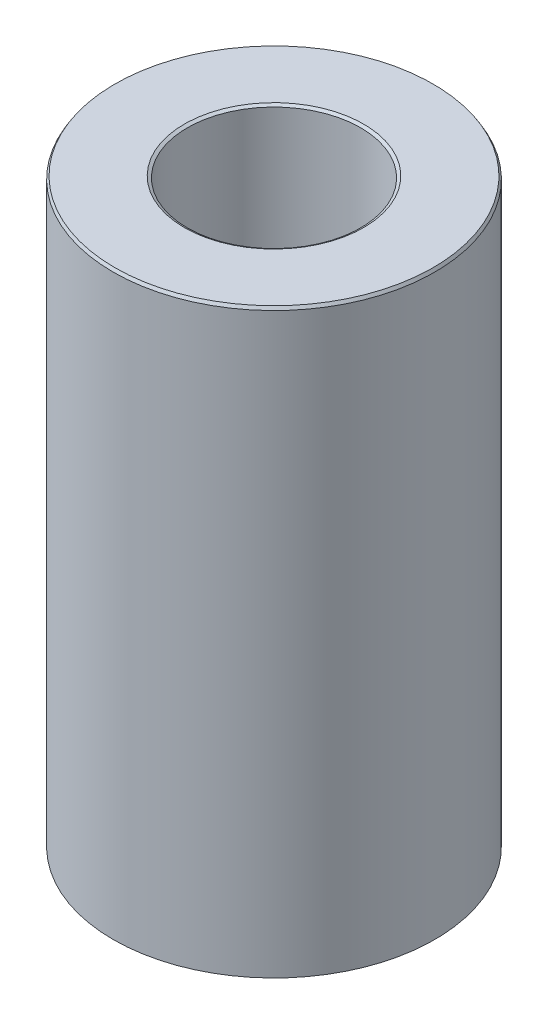
ISO-10303-21;
HEADER;
FILE_DESCRIPTION(('STEP AP214'),'2;1');
FILE_NAME('part.step','',(''),(''),'','','');
FILE_SCHEMA(('AUTOMOTIVE_DESIGN { 1 0 10303 214 1 1 1 1 }'));
ENDSEC;
DATA;
#1=APPLICATION_CONTEXT('core data for automotive mechanical design processes');
#2=APPLICATION_PROTOCOL_DEFINITION('international standard','automotive_design',2000,#1);
#3=PRODUCT_CONTEXT('',#1,'mechanical');
#4=PRODUCT('Part','Part','',(#3));
#5=PRODUCT_RELATED_PRODUCT_CATEGORY('part','',(#4));
#6=PRODUCT_DEFINITION_FORMATION('','',#4);
#7=PRODUCT_DEFINITION_CONTEXT('part definition',#1,'design');
#8=PRODUCT_DEFINITION('design','',#6,#7);
#9=PRODUCT_DEFINITION_SHAPE('','',#8);
#10=(LENGTH_UNIT() NAMED_UNIT(*) SI_UNIT(.MILLI.,.METRE.));
#11=(NAMED_UNIT(*) PLANE_ANGLE_UNIT() SI_UNIT($,.RADIAN.));
#12=(NAMED_UNIT(*) SI_UNIT($,.STERADIAN.) SOLID_ANGLE_UNIT());
#13=UNCERTAINTY_MEASURE_WITH_UNIT(LENGTH_MEASURE(1.E-05),#10,'distance_accuracy_value','');
#14=(GEOMETRIC_REPRESENTATION_CONTEXT(3) GLOBAL_UNCERTAINTY_ASSIGNED_CONTEXT((#13)) GLOBAL_UNIT_ASSIGNED_CONTEXT((#10,
#11,#12)) REPRESENTATION_CONTEXT('',''));
#15=CARTESIAN_POINT('',(0.,0.,0.));
#16=DIRECTION('',(0.,0.,1.));
#17=DIRECTION('',(1.,0.,0.));
#18=AXIS2_PLACEMENT_3D('',#15,#16,#17);
#19=CARTESIAN_POINT('',(0.,172.119803499894,0.));
#20=DIRECTION('',(0.,-1.,0.));
#21=DIRECTION('',(0.,0.,-1.));
#22=AXIS2_PLACEMENT_3D('',#19,#20,#21);
#23=CYLINDRICAL_SURFACE('',#22,47.5);
#24=CARTESIAN_POINT('',(0.,0.505788160574006,0.));
#25=DIRECTION('',(0.,1.,0.));
#26=DIRECTION('',(0.,0.,1.));
#27=AXIS2_PLACEMENT_3D('',#24,#25,#26);
#28=CIRCLE('',#27,47.5);
#29=CARTESIAN_POINT('',(0.,0.505788160574006,47.5));
#30=VERTEX_POINT('',#29);
#31=EDGE_CURVE('E10',#30,#30,#28,.T.);
#32=ORIENTED_EDGE('',*,*,#31,.T.);
#33=EDGE_LOOP('',(#32));
#34=FACE_BOUND('',#33,.T.);
#35=CARTESIAN_POINT('',(0.,171.243752707913,0.));
#36=DIRECTION('',(0.,1.,0.));
#37=DIRECTION('',(0.,0.,1.));
#38=AXIS2_PLACEMENT_3D('',#35,#36,#37);
#39=CIRCLE('',#38,47.5);
#40=CARTESIAN_POINT('',(0.,171.243752707913,47.5));
#41=VERTEX_POINT('',#40);
#42=EDGE_CURVE('E50',#41,#41,#39,.F.);
#43=ORIENTED_EDGE('',*,*,#42,.T.);
#44=EDGE_LOOP('',(#43));
#45=FACE_BOUND('',#44,.T.);
#46=ADVANCED_FACE('F39',(#34,#45),#23,.T.);
#47=CARTESIAN_POINT('',(0.,172.119803499894,0.));
#48=DIRECTION('',(0.,1.,0.));
#49=DIRECTION('',(0.,0.,1.));
#50=AXIS2_PLACEMENT_3D('',#47,#48,#49);
#51=PLANE('',#50);
#52=CARTESIAN_POINT('',(0.,172.119803499894,0.));
#53=DIRECTION('',(0.,1.,0.));
#54=DIRECTION('',(0.,0.,1.));
#55=AXIS2_PLACEMENT_3D('',#52,#53,#54);
#56=CIRCLE('',#55,26.4885482199525);
#57=CARTESIAN_POINT('',(0.,172.119803499894,26.4885482199525));
#58=VERTEX_POINT('',#57);
#59=EDGE_CURVE('E58',#58,#58,#56,.F.);
#60=ORIENTED_EDGE('',*,*,#59,.T.);
#61=EDGE_LOOP('',(#60));
#62=FACE_BOUND('',#61,.T.);
#63=CARTESIAN_POINT('',(0.,172.119803499894,0.));
#64=DIRECTION('',(0.,1.,0.));
#65=DIRECTION('',(0.,0.,1.));
#66=AXIS2_PLACEMENT_3D('',#63,#64,#65);
#67=CIRCLE('',#66,46.994211839426);
#68=CARTESIAN_POINT('',(0.,172.119803499894,46.994211839426));
#69=VERTEX_POINT('',#68);
#70=EDGE_CURVE('E61',#69,#69,#67,.T.);
#71=ORIENTED_EDGE('',*,*,#70,.T.);
#72=EDGE_LOOP('',(#71));
#73=FACE_BOUND('',#72,.T.);
#74=ADVANCED_FACE('F88',(#62,#73),#51,.T.);
#75=CARTESIAN_POINT('',(0.,0.,0.));
#76=DIRECTION('',(0.,1.,0.));
#77=DIRECTION('',(0.,0.,1.));
#78=AXIS2_PLACEMENT_3D('',#75,#76,#77);
#79=PLANE('',#78);
#80=CARTESIAN_POINT('',(0.,0.,0.));
#81=DIRECTION('',(0.,1.,0.));
#82=DIRECTION('',(0.,0.,1.));
#83=AXIS2_PLACEMENT_3D('',#80,#81,#82);
#84=CIRCLE('',#83,26.1182855885455);
#85=CARTESIAN_POINT('',(0.,0.,-26.1182855885455));
#86=VERTEX_POINT('',#85);
#87=EDGE_CURVE('E51',#86,#86,#84,.T.);
#88=ORIENTED_EDGE('',*,*,#87,.T.);
#89=EDGE_LOOP('',(#88));
#90=FACE_BOUND('',#89,.T.);
#91=CARTESIAN_POINT('',(0.,0.,0.));
#92=DIRECTION('',(0.,1.,0.));
#93=DIRECTION('',(0.,0.,1.));
#94=AXIS2_PLACEMENT_3D('',#91,#92,#93);
#95=CIRCLE('',#94,46.623949208019);
#96=CARTESIAN_POINT('',(0.,0.,46.623949208019));
#97=VERTEX_POINT('',#96);
#98=EDGE_CURVE('E54',#97,#97,#95,.F.);
#99=ORIENTED_EDGE('',*,*,#98,.T.);
#100=EDGE_LOOP('',(#99));
#101=FACE_BOUND('',#100,.T.);
#102=ADVANCED_FACE('F83',(#90,#101),#79,.F.);
#103=CARTESIAN_POINT('',(0.,172.119803499894,0.));
#104=DIRECTION('',(0.,-1.,0.));
#105=DIRECTION('',(0.,0.,-1.));
#106=AXIS2_PLACEMENT_3D('',#103,#104,#105);
#107=CYLINDRICAL_SURFACE('',#106,25.6124974279715);
#108=CARTESIAN_POINT('',(0.,171.61401533932,0.));
#109=DIRECTION('',(0.,1.,0.));
#110=DIRECTION('',(0.,0.,1.));
#111=AXIS2_PLACEMENT_3D('',#108,#109,#110);
#112=CIRCLE('',#111,25.6124974279715);
#113=CARTESIAN_POINT('',(0.,171.61401533932,25.6124974279715));
#114=VERTEX_POINT('',#113);
#115=EDGE_CURVE('E67',#114,#114,#112,.T.);
#116=ORIENTED_EDGE('',*,*,#115,.T.);
#117=EDGE_LOOP('',(#116));
#118=FACE_BOUND('',#117,.T.);
#119=CARTESIAN_POINT('',(0.,0.87605079198097,0.));
#120=DIRECTION('',(0.,1.,0.));
#121=DIRECTION('',(0.,0.,1.));
#122=AXIS2_PLACEMENT_3D('',#119,#120,#121);
#123=CIRCLE('',#122,25.6124974279715);
#124=CARTESIAN_POINT('',(0.,0.87605079198097,-25.6124974279715));
#125=VERTEX_POINT('',#124);
#126=EDGE_CURVE('E69',#125,#125,#123,.F.);
#127=ORIENTED_EDGE('',*,*,#126,.T.);
#128=EDGE_LOOP('',(#127));
#129=FACE_BOUND('',#128,.T.);
#130=ADVANCED_FACE('F71',(#118,#129),#107,.F.);
#131=CARTESIAN_POINT('',(0.,171.61401533932,0.));
#132=DIRECTION('',(0.,1.,0.));
#133=DIRECTION('',(0.,0.,1.));
#134=AXIS2_PLACEMENT_3D('',#131,#132,#133);
#135=CONICAL_SURFACE('',#134,25.6124974279715,1.04719755119661);
#136=ORIENTED_EDGE('',*,*,#59,.F.);
#137=EDGE_LOOP('',(#136));
#138=FACE_BOUND('',#137,.T.);
#139=ORIENTED_EDGE('',*,*,#115,.F.);
#140=EDGE_LOOP('',(#139));
#141=FACE_BOUND('',#140,.T.);
#142=ADVANCED_FACE('F77',(#138,#141),#135,.F.);
#143=CARTESIAN_POINT('',(0.,0.,0.));
#144=DIRECTION('',(0.,-1.,0.));
#145=DIRECTION('',(0.,0.,-1.));
#146=AXIS2_PLACEMENT_3D('',#143,#144,#145);
#147=CONICAL_SURFACE('',#146,26.1182855885455,0.523598775598296);
#148=CARTESIAN_POINT('',(0.,0.87605079198097,-25.6124974279715));
#149=CARTESIAN_POINT('',(0.,0.866925262897835,-25.6177660546442));
#150=CARTESIAN_POINT('',(0.,0.8577997338147,-25.6230346813168));
#151=CARTESIAN_POINT('',(0.,0.83954867564843,-25.6335719346621));
#152=CARTESIAN_POINT('',(0.,0.830423146565294,-25.6388405613348));
#153=CARTESIAN_POINT('',(0.,0.812172088399024,-25.6493778146801));
#154=CARTESIAN_POINT('',(0.,0.803046559315889,-25.6546464413527));
#155=CARTESIAN_POINT('',(0.,0.784795501149619,-25.665183694698));
#156=CARTESIAN_POINT('',(0.,0.775669972066484,-25.6704523213706));
#157=CARTESIAN_POINT('',(0.,0.757418913900214,-25.6809895747159));
#158=CARTESIAN_POINT('',(0.,0.748293384817079,-25.6862582013886));
#159=CARTESIAN_POINT('',(0.,0.730042326650808,-25.6967954547339));
#160=CARTESIAN_POINT('',(0.,0.720916797567673,-25.7020640814065));
#161=CARTESIAN_POINT('',(0.,0.702665739401403,-25.7126013347518));
#162=CARTESIAN_POINT('',(0.,0.693540210318268,-25.7178699614245));
#163=CARTESIAN_POINT('',(0.,0.675289152151998,-25.7284072147697));
#164=CARTESIAN_POINT('',(0.,0.666163623068863,-25.7336758414424));
#165=CARTESIAN_POINT('',(0.,0.647912564902592,-25.7442130947877));
#166=CARTESIAN_POINT('',(0.,0.638787035819457,-25.7494817214603));
#167=CARTESIAN_POINT('',(0.,0.620535977653187,-25.7600189748056));
#168=CARTESIAN_POINT('',(0.,0.611410448570052,-25.7652876014783));
#169=CARTESIAN_POINT('',(0.,0.593159390403782,-25.7758248548236));
#170=CARTESIAN_POINT('',(0.,0.584033861320647,-25.7810934814962));
#171=CARTESIAN_POINT('',(0.,0.565782803154376,-25.7916307348415));
#172=CARTESIAN_POINT('',(0.,0.556657274071241,-25.7968993615141));
#173=CARTESIAN_POINT('',(0.,0.538406215904971,-25.8074366148594));
#174=CARTESIAN_POINT('',(0.,0.529280686821836,-25.8127052415321));
#175=CARTESIAN_POINT('',(0.,0.511029628655566,-25.8232424948774));
#176=CARTESIAN_POINT('',(0.,0.501904099572431,-25.82851112155));
#177=CARTESIAN_POINT('',(0.,0.48365304140616,-25.8390483748953));
#178=CARTESIAN_POINT('',(0.,0.474527512323025,-25.844317001568));
#179=CARTESIAN_POINT('',(0.,0.456276454156755,-25.8548542549132));
#180=CARTESIAN_POINT('',(0.,0.44715092507362,-25.8601228815859));
#181=CARTESIAN_POINT('',(0.,0.42889986690735,-25.8706601349312));
#182=CARTESIAN_POINT('',(0.,0.419774337824215,-25.8759287616038));
#183=CARTESIAN_POINT('',(0.,0.401523279657944,-25.8864660149491));
#184=CARTESIAN_POINT('',(0.,0.392397750574809,-25.8917346416218));
#185=CARTESIAN_POINT('',(0.,0.374146692408539,-25.9022718949671));
#186=CARTESIAN_POINT('',(0.,0.365021163325404,-25.9075405216397));
#187=CARTESIAN_POINT('',(0.,0.346770105159134,-25.918077774985));
#188=CARTESIAN_POINT('',(0.,0.337644576075999,-25.9233464016576));
#189=CARTESIAN_POINT('',(0.,0.319393517909729,-25.9338836550029));
#190=CARTESIAN_POINT('',(0.,0.310267988826594,-25.9391522816756));
#191=CARTESIAN_POINT('',(0.,0.292016930660323,-25.9496895350209));
#192=CARTESIAN_POINT('',(0.,0.282891401577188,-25.9549581616935));
#193=CARTESIAN_POINT('',(0.,0.264640343410918,-25.9654954150388));
#194=CARTESIAN_POINT('',(0.,0.255514814327783,-25.9707640417115));
#195=CARTESIAN_POINT('',(0.,0.237263756161513,-25.9813012950567));
#196=CARTESIAN_POINT('',(0.,0.228138227078378,-25.9865699217294));
#197=CARTESIAN_POINT('',(0.,0.209887168912107,-25.9971071750747));
#198=CARTESIAN_POINT('',(0.,0.200761639828972,-26.0023758017473));
#199=CARTESIAN_POINT('',(0.,0.182510581662702,-26.0129130550926));
#200=CARTESIAN_POINT('',(0.,0.173385052579567,-26.0181816817653));
#201=CARTESIAN_POINT('',(0.,0.155133994413297,-26.0287189351106));
#202=CARTESIAN_POINT('',(0.,0.146008465330161,-26.0339875617832));
#203=CARTESIAN_POINT('',(0.,0.127757407163891,-26.0445248151285));
#204=CARTESIAN_POINT('',(0.,0.118631878080756,-26.0497934418011));
#205=CARTESIAN_POINT('',(0.,0.100380819914486,-26.0603306951464));
#206=CARTESIAN_POINT('',(0.,0.0912552908313511,-26.0655993218191));
#207=CARTESIAN_POINT('',(0.,0.0730042326650808,-26.0761365751644));
#208=CARTESIAN_POINT('',(0.,0.0638787035819457,-26.081405201837));
#209=CARTESIAN_POINT('',(0.,0.0456276454156755,-26.0919424551823));
#210=CARTESIAN_POINT('',(0.,0.0365021163325404,-26.097211081855));
#211=CARTESIAN_POINT('',(0.,0.0182510581662702,-26.1077483352002));
#212=CARTESIAN_POINT('',(0.,0.0091255290831351,-26.1130169618729));
#213=CARTESIAN_POINT('',(0.,0.,-26.1182855885455));
#214=B_SPLINE_CURVE_WITH_KNOTS('',3,(#148,#149,#150,#151,#152,#153,#154,#155,#156,#157,#158,
#159,#160,#161,#162,#163,#164,#165,#166,#167,#168,#169,#170,#171,#172,#173,#174,#175,#176,#177,
#178,#179,#180,#181,#182,#183,#184,#185,#186,#187,#188,#189,#190,#191,#192,#193,#194,#195,#196,
#197,#198,#199,#200,#201,#202,#203,#204,#205,#206,#207,#208,#209,#210,#211,#212,#213),
.UNSPECIFIED.,.F.,.F.,(4,2,2,2,2,2,2,2,2,2,2,2,2,2,2,2,2,2,2,2,2,2,2,2,2,2,2,2,2,2,2,2,4),(0.,
0.031611760035875,0.06322352007175,0.094835280107625,0.1264470401435,0.158058800179375,
0.189670560215248,0.221282320251123,0.252894080286998,0.284505840322873,0.316117600358748,
0.347729360394623,0.379341120430498,0.410952880466373,0.442564640502248,0.474176400538123,
0.505788160573998,0.537399920609871,0.569011680645746,0.600623440681621,0.632235200717496,
0.663846960753371,0.695458720789246,0.727070480825121,0.758682240860996,0.790294000896871,
0.821905760932746,0.85351752096862,0.885129281004495,0.91674104104037,0.948352801076245,
0.97996456111212,1.01157632114799),.UNSPECIFIED.);
#215=EDGE_CURVE('BSEAM73',#125,#86,#214,.T.);
#216=ORIENTED_EDGE('',*,*,#126,.F.);
#217=ORIENTED_EDGE('',*,*,#87,.F.);
#218=ORIENTED_EDGE('',*,*,#215,.T.);
#219=ORIENTED_EDGE('',*,*,#215,.F.);
#220=EDGE_LOOP('',(#216,#218,#217,#219));
#221=FACE_BOUND('',#220,.T.);
#222=ADVANCED_FACE('F73',(#221),#147,.F.);
#223=CARTESIAN_POINT('',(0.,0.505788160574006,0.));
#224=DIRECTION('',(0.,1.,0.));
#225=DIRECTION('',(0.,0.,1.));
#226=AXIS2_PLACEMENT_3D('',#223,#224,#225);
#227=CONICAL_SURFACE('',#226,47.5,1.0471975511966);
#228=ORIENTED_EDGE('',*,*,#98,.F.);
#229=EDGE_LOOP('',(#228));
#230=FACE_BOUND('',#229,.T.);
#231=ORIENTED_EDGE('',*,*,#31,.F.);
#232=EDGE_LOOP('',(#231));
#233=FACE_BOUND('',#232,.T.);
#234=ADVANCED_FACE('F76',(#230,#233),#227,.T.);
#235=CARTESIAN_POINT('',(0.,172.119803499894,0.));
#236=DIRECTION('',(0.,-1.,0.));
#237=DIRECTION('',(0.,0.,-1.));
#238=AXIS2_PLACEMENT_3D('',#235,#236,#237);
#239=CONICAL_SURFACE('',#238,46.994211839426,0.523598775598292);
#240=ORIENTED_EDGE('',*,*,#42,.F.);
#241=EDGE_LOOP('',(#240));
#242=FACE_BOUND('',#241,.T.);
#243=ORIENTED_EDGE('',*,*,#70,.F.);
#244=EDGE_LOOP('',(#243));
#245=FACE_BOUND('',#244,.T.);
#246=ADVANCED_FACE('F45',(#242,#245),#239,.T.);
#247=CLOSED_SHELL('',(#46,#74,#102,#130,#142,#222,#234,#246));
#248=MANIFOLD_SOLID_BREP('B2',#247);
#249=ADVANCED_BREP_SHAPE_REPRESENTATION('',(#18,#248),#14);
#250=SHAPE_DEFINITION_REPRESENTATION(#9,#249);
ENDSEC;
END-ISO-10303-21;
